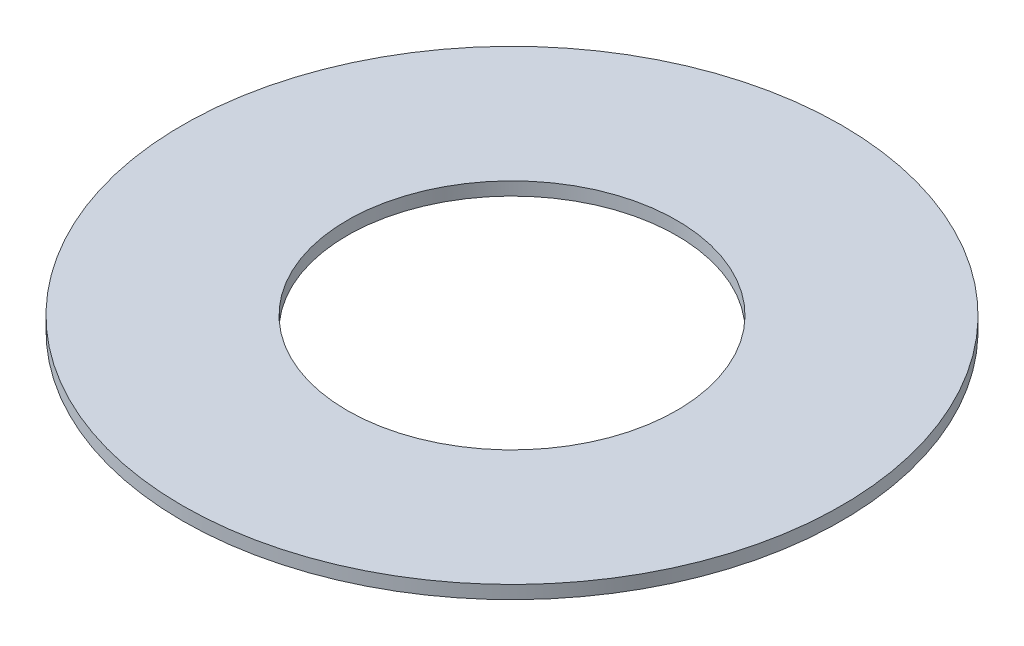
ISO-10303-21;
HEADER;
FILE_DESCRIPTION(('STEP AP214'),'2;1');
FILE_NAME('part.step','',(''),(''),'','','');
FILE_SCHEMA(('AUTOMOTIVE_DESIGN { 1 0 10303 214 1 1 1 1 }'));
ENDSEC;
DATA;
#1=APPLICATION_CONTEXT('core data for automotive mechanical design processes');
#2=APPLICATION_PROTOCOL_DEFINITION('international standard','automotive_design',2000,#1);
#3=PRODUCT_CONTEXT('',#1,'mechanical');
#4=PRODUCT('Part','Part','',(#3));
#5=PRODUCT_RELATED_PRODUCT_CATEGORY('part','',(#4));
#6=PRODUCT_DEFINITION_FORMATION('','',#4);
#7=PRODUCT_DEFINITION_CONTEXT('part definition',#1,'design');
#8=PRODUCT_DEFINITION('design','',#6,#7);
#9=PRODUCT_DEFINITION_SHAPE('','',#8);
#10=(LENGTH_UNIT() NAMED_UNIT(*) SI_UNIT(.MILLI.,.METRE.));
#11=(NAMED_UNIT(*) PLANE_ANGLE_UNIT() SI_UNIT($,.RADIAN.));
#12=(NAMED_UNIT(*) SI_UNIT($,.STERADIAN.) SOLID_ANGLE_UNIT());
#13=UNCERTAINTY_MEASURE_WITH_UNIT(LENGTH_MEASURE(1.E-05),#10,'distance_accuracy_value','');
#14=(GEOMETRIC_REPRESENTATION_CONTEXT(3) GLOBAL_UNCERTAINTY_ASSIGNED_CONTEXT((#13)) GLOBAL_UNIT_ASSIGNED_CONTEXT((#10,
#11,#12)) REPRESENTATION_CONTEXT('',''));
#15=CARTESIAN_POINT('',(0.,0.,0.));
#16=DIRECTION('',(0.,0.,1.));
#17=DIRECTION('',(1.,0.,0.));
#18=AXIS2_PLACEMENT_3D('',#15,#16,#17);
#19=CARTESIAN_POINT('',(0.,0.200000000000006,0.));
#20=DIRECTION('',(0.,-1.,0.));
#21=DIRECTION('',(0.,0.,-1.));
#22=AXIS2_PLACEMENT_3D('',#19,#20,#21);
#23=CYLINDRICAL_SURFACE('',#22,5.);
#24=CARTESIAN_POINT('',(0.,0.200000000000006,0.));
#25=DIRECTION('',(0.,1.,0.));
#26=DIRECTION('',(0.,0.,1.));
#27=AXIS2_PLACEMENT_3D('',#24,#25,#26);
#28=CIRCLE('',#27,5.);
#29=CARTESIAN_POINT('',(0.,0.200000000000006,5.));
#30=VERTEX_POINT('',#29);
#31=EDGE_CURVE('E10',#30,#30,#28,.T.);
#32=ORIENTED_EDGE('',*,*,#31,.F.);
#33=EDGE_LOOP('',(#32));
#34=FACE_BOUND('',#33,.T.);
#35=CARTESIAN_POINT('',(0.,0.,0.));
#36=DIRECTION('',(0.,1.,0.));
#37=DIRECTION('',(0.,0.,1.));
#38=AXIS2_PLACEMENT_3D('',#35,#36,#37);
#39=CIRCLE('',#38,5.);
#40=CARTESIAN_POINT('',(0.,0.,5.));
#41=VERTEX_POINT('',#40);
#42=EDGE_CURVE('E37',#41,#41,#39,.T.);
#43=ORIENTED_EDGE('',*,*,#42,.T.);
#44=EDGE_LOOP('',(#43));
#45=FACE_BOUND('',#44,.T.);
#46=ADVANCED_FACE('F34',(#34,#45),#23,.T.);
#47=CARTESIAN_POINT('',(0.,0.200000000000006,0.));
#48=DIRECTION('',(0.,1.,0.));
#49=DIRECTION('',(0.,0.,1.));
#50=AXIS2_PLACEMENT_3D('',#47,#48,#49);
#51=PLANE('',#50);
#52=CARTESIAN_POINT('',(0.,0.200000000000006,0.));
#53=DIRECTION('',(0.,1.,0.));
#54=DIRECTION('',(0.,0.,1.));
#55=AXIS2_PLACEMENT_3D('',#52,#53,#54);
#56=CIRCLE('',#55,2.5);
#57=CARTESIAN_POINT('',(0.,0.200000000000006,2.5));
#58=VERTEX_POINT('',#57);
#59=EDGE_CURVE('E46',#58,#58,#56,.T.);
#60=ORIENTED_EDGE('',*,*,#59,.F.);
#61=EDGE_LOOP('',(#60));
#62=FACE_BOUND('',#61,.T.);
#63=ORIENTED_EDGE('',*,*,#31,.T.);
#64=EDGE_LOOP('',(#63));
#65=FACE_BOUND('',#64,.T.);
#66=ADVANCED_FACE('F61',(#62,#65),#51,.T.);
#67=CARTESIAN_POINT('',(0.,0.,0.));
#68=DIRECTION('',(0.,1.,0.));
#69=DIRECTION('',(0.,0.,1.));
#70=AXIS2_PLACEMENT_3D('',#67,#68,#69);
#71=PLANE('',#70);
#72=CARTESIAN_POINT('',(0.,0.,0.));
#73=DIRECTION('',(0.,1.,0.));
#74=DIRECTION('',(0.,0.,1.));
#75=AXIS2_PLACEMENT_3D('',#72,#73,#74);
#76=CIRCLE('',#75,2.5);
#77=CARTESIAN_POINT('',(0.,0.,2.5));
#78=VERTEX_POINT('',#77);
#79=EDGE_CURVE('E44',#78,#78,#76,.T.);
#80=ORIENTED_EDGE('',*,*,#79,.T.);
#81=EDGE_LOOP('',(#80));
#82=FACE_BOUND('',#81,.T.);
#83=ORIENTED_EDGE('',*,*,#42,.F.);
#84=EDGE_LOOP('',(#83));
#85=FACE_BOUND('',#84,.T.);
#86=ADVANCED_FACE('F52',(#82,#85),#71,.F.);
#87=CARTESIAN_POINT('',(0.,0.,0.));
#88=DIRECTION('',(0.,1.,0.));
#89=DIRECTION('',(0.,0.,1.));
#90=AXIS2_PLACEMENT_3D('',#87,#88,#89);
#91=CYLINDRICAL_SURFACE('',#90,2.5);
#92=ORIENTED_EDGE('',*,*,#79,.F.);
#93=EDGE_LOOP('',(#92));
#94=FACE_BOUND('',#93,.T.);
#95=ORIENTED_EDGE('',*,*,#59,.T.);
#96=EDGE_LOOP('',(#95));
#97=FACE_BOUND('',#96,.T.);
#98=ADVANCED_FACE('F55',(#94,#97),#91,.F.);
#99=CLOSED_SHELL('',(#46,#66,#86,#98));
#100=MANIFOLD_SOLID_BREP('B2',#99);
#101=ADVANCED_BREP_SHAPE_REPRESENTATION('',(#18,#100),#14);
#102=SHAPE_DEFINITION_REPRESENTATION(#9,#101);
ENDSEC;
END-ISO-10303-21;
